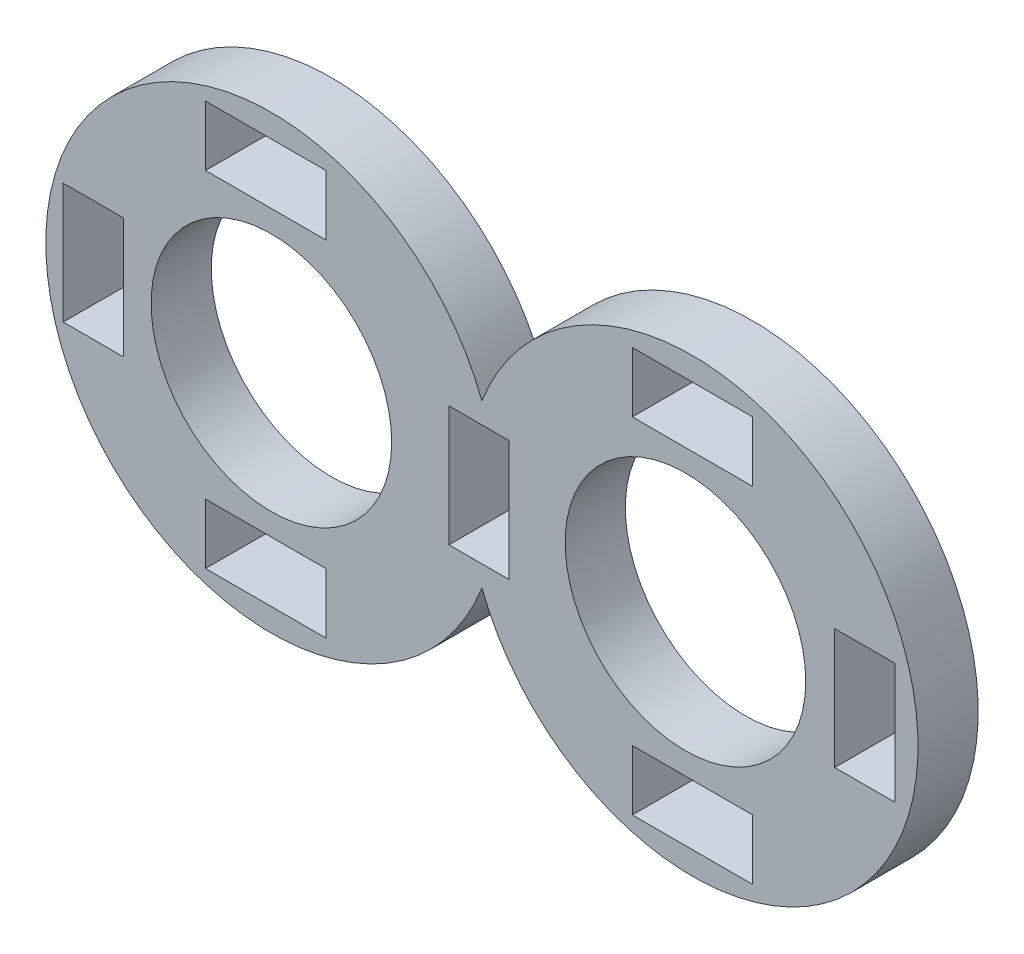
ISO-10303-21;
HEADER;
FILE_DESCRIPTION(('STEP AP214'),'2;1');
FILE_NAME('part.step','',(''),(''),'','','');
FILE_SCHEMA(('AUTOMOTIVE_DESIGN { 1 0 10303 214 1 1 1 1 }'));
ENDSEC;
DATA;
#1=APPLICATION_CONTEXT('core data for automotive mechanical design processes');
#2=APPLICATION_PROTOCOL_DEFINITION('international standard','automotive_design',2000,#1);
#3=PRODUCT_CONTEXT('',#1,'mechanical');
#4=PRODUCT('Part','Part','',(#3));
#5=PRODUCT_RELATED_PRODUCT_CATEGORY('part','',(#4));
#6=PRODUCT_DEFINITION_FORMATION('','',#4);
#7=PRODUCT_DEFINITION_CONTEXT('part definition',#1,'design');
#8=PRODUCT_DEFINITION('design','',#6,#7);
#9=PRODUCT_DEFINITION_SHAPE('','',#8);
#10=(LENGTH_UNIT() NAMED_UNIT(*) SI_UNIT(.MILLI.,.METRE.));
#11=(NAMED_UNIT(*) PLANE_ANGLE_UNIT() SI_UNIT($,.RADIAN.));
#12=(NAMED_UNIT(*) SI_UNIT($,.STERADIAN.) SOLID_ANGLE_UNIT());
#13=UNCERTAINTY_MEASURE_WITH_UNIT(LENGTH_MEASURE(1.E-05),#10,'distance_accuracy_value','');
#14=(GEOMETRIC_REPRESENTATION_CONTEXT(3) GLOBAL_UNCERTAINTY_ASSIGNED_CONTEXT((#13)) GLOBAL_UNIT_ASSIGNED_CONTEXT((#10,
#11,#12)) REPRESENTATION_CONTEXT('',''));
#15=CARTESIAN_POINT('',(0.,0.,0.));
#16=DIRECTION('',(0.,0.,1.));
#17=DIRECTION('',(1.,0.,0.));
#18=AXIS2_PLACEMENT_3D('',#15,#16,#17);
#19=CARTESIAN_POINT('',(0.,0.,1.));
#20=DIRECTION('',(0.,0.,-1.));
#21=DIRECTION('',(-1.,0.,0.));
#22=AXIS2_PLACEMENT_3D('',#19,#20,#21);
#23=CYLINDRICAL_SURFACE('',#22,3.75);
#24=DIRECTION('',(0.,0.,-1.));
#25=VECTOR('',#24,1.);
#26=CARTESIAN_POINT('',(3.5,-1.34629120178362,0.5));
#27=LINE('',#26,#25);
#28=CARTESIAN_POINT('',(3.5,-1.34629120178362,1.));
#29=VERTEX_POINT('',#28);
#30=CARTESIAN_POINT('',(3.5,-1.34629120178362,0.));
#31=VERTEX_POINT('',#30);
#32=EDGE_CURVE('E12',#29,#31,#27,.T.);
#33=ORIENTED_EDGE('',*,*,#32,.F.);
#34=CARTESIAN_POINT('',(0.,0.,1.));
#35=DIRECTION('',(0.,0.,1.));
#36=DIRECTION('',(1.,0.,0.));
#37=AXIS2_PLACEMENT_3D('',#34,#35,#36);
#38=CIRCLE('',#37,3.75);
#39=CARTESIAN_POINT('',(3.5,1.34629120178362,1.));
#40=VERTEX_POINT('',#39);
#41=EDGE_CURVE('E571',#40,#29,#38,.T.);
#42=ORIENTED_EDGE('',*,*,#41,.F.);
#43=DIRECTION('',(0.,0.,-1.));
#44=VECTOR('',#43,1.);
#45=CARTESIAN_POINT('',(3.5,1.34629120178362,0.5));
#46=LINE('',#45,#44);
#47=CARTESIAN_POINT('',(3.5,1.34629120178362,0.));
#48=VERTEX_POINT('',#47);
#49=EDGE_CURVE('E53',#48,#40,#46,.F.);
#50=ORIENTED_EDGE('',*,*,#49,.F.);
#51=CARTESIAN_POINT('',(0.,0.,0.));
#52=DIRECTION('',(0.,0.,1.));
#53=DIRECTION('',(1.,0.,0.));
#54=AXIS2_PLACEMENT_3D('',#51,#52,#53);
#55=CIRCLE('',#54,3.75);
#56=EDGE_CURVE('E575',#48,#31,#55,.T.);
#57=ORIENTED_EDGE('',*,*,#56,.T.);
#58=EDGE_LOOP('',(#33,#42,#50,#57));
#59=FACE_BOUND('',#58,.T.);
#60=ADVANCED_FACE('F44',(#59),#23,.T.);
#61=CARTESIAN_POINT('',(0.,0.,0.));
#62=DIRECTION('',(0.,0.,1.));
#63=DIRECTION('',(1.,0.,0.));
#64=AXIS2_PLACEMENT_3D('',#61,#62,#63);
#65=PLANE('',#64);
#66=DIRECTION('',(1.,0.,0.));
#67=VECTOR('',#66,1.);
#68=CARTESIAN_POINT('',(0.,0.999999999999997,0.));
#69=LINE('',#68,#67);
#70=CARTESIAN_POINT('',(9.36532028956779,0.999999999999997,0.));
#71=VERTEX_POINT('',#70);
#72=CARTESIAN_POINT('',(10.3653202895678,0.999999999999997,0.));
#73=VERTEX_POINT('',#72);
#74=EDGE_CURVE('E278',#71,#73,#69,.T.);
#75=ORIENTED_EDGE('',*,*,#74,.F.);
#76=DIRECTION('',(0.,1.,0.));
#77=VECTOR('',#76,1.);
#78=CARTESIAN_POINT('',(9.36532028956779,0.,0.));
#79=LINE('',#78,#77);
#80=CARTESIAN_POINT('',(9.36532028956779,-1.,0.));
#81=VERTEX_POINT('',#80);
#82=EDGE_CURVE('E60',#81,#71,#79,.T.);
#83=ORIENTED_EDGE('',*,*,#82,.F.);
#84=DIRECTION('',(-1.,0.,0.));
#85=VECTOR('',#84,1.);
#86=CARTESIAN_POINT('',(0.,-1.,0.));
#87=LINE('',#86,#85);
#88=CARTESIAN_POINT('',(10.3653202895678,-1.,0.));
#89=VERTEX_POINT('',#88);
#90=EDGE_CURVE('E265',#89,#81,#87,.T.);
#91=ORIENTED_EDGE('',*,*,#90,.F.);
#92=DIRECTION('',(0.,-1.,0.));
#93=VECTOR('',#92,1.);
#94=CARTESIAN_POINT('',(10.3653202895678,0.,0.));
#95=LINE('',#94,#93);
#96=EDGE_CURVE('E269',#73,#89,#95,.T.);
#97=ORIENTED_EDGE('',*,*,#96,.F.);
#98=EDGE_LOOP('',(#75,#83,#91,#97));
#99=FACE_BOUND('',#98,.T.);
#100=DIRECTION('',(-1.,0.,0.));
#101=VECTOR('',#100,1.);
#102=CARTESIAN_POINT('',(0.,-0.999999999999998,0.));
#103=LINE('',#102,#101);
#104=CARTESIAN_POINT('',(3.95230876838334,-0.999999999999997,0.));
#105=VERTEX_POINT('',#104);
#106=CARTESIAN_POINT('',(2.95230876838334,-0.999999999999997,0.));
#107=VERTEX_POINT('',#106);
#108=EDGE_CURVE('E360',#105,#107,#103,.T.);
#109=ORIENTED_EDGE('',*,*,#108,.F.);
#110=DIRECTION('',(0.,-1.,0.));
#111=VECTOR('',#110,1.);
#112=CARTESIAN_POINT('',(3.95230876838334,0.,0.));
#113=LINE('',#112,#111);
#114=CARTESIAN_POINT('',(3.95230876838334,0.999999999999998,0.));
#115=VERTEX_POINT('',#114);
#116=EDGE_CURVE('E68',#115,#105,#113,.T.);
#117=ORIENTED_EDGE('',*,*,#116,.F.);
#118=DIRECTION('',(1.,0.,0.));
#119=VECTOR('',#118,1.);
#120=CARTESIAN_POINT('',(0.,0.999999999999997,0.));
#121=LINE('',#120,#119);
#122=CARTESIAN_POINT('',(2.95230876838334,0.999999999999997,0.));
#123=VERTEX_POINT('',#122);
#124=EDGE_CURVE('E345',#123,#115,#121,.T.);
#125=ORIENTED_EDGE('',*,*,#124,.F.);
#126=DIRECTION('',(0.,1.,0.));
#127=VECTOR('',#126,1.);
#128=CARTESIAN_POINT('',(2.95230876838334,0.,0.));
#129=LINE('',#128,#127);
#130=EDGE_CURVE('E364',#107,#123,#129,.T.);
#131=ORIENTED_EDGE('',*,*,#130,.F.);
#132=EDGE_LOOP('',(#109,#117,#125,#131));
#133=FACE_BOUND('',#132,.T.);
#134=DIRECTION('',(1.,0.,0.));
#135=VECTOR('',#134,1.);
#136=CARTESIAN_POINT('',(0.,0.999999999999997,0.));
#137=LINE('',#136,#135);
#138=CARTESIAN_POINT('',(-3.46070275280111,0.999999999999997,0.));
#139=VERTEX_POINT('',#138);
#140=CARTESIAN_POINT('',(-2.46070275280111,0.999999999999997,0.));
#141=VERTEX_POINT('',#140);
#142=EDGE_CURVE('E315',#139,#141,#137,.T.);
#143=ORIENTED_EDGE('',*,*,#142,.F.);
#144=DIRECTION('',(0.,1.,0.));
#145=VECTOR('',#144,1.);
#146=CARTESIAN_POINT('',(-3.46070275280111,0.,0.));
#147=LINE('',#146,#145);
#148=CARTESIAN_POINT('',(-3.46070275280111,-1.,0.));
#149=VERTEX_POINT('',#148);
#150=EDGE_CURVE('E312',#149,#139,#147,.T.);
#151=ORIENTED_EDGE('',*,*,#150,.F.);
#152=DIRECTION('',(-1.,0.,0.));
#153=VECTOR('',#152,1.);
#154=CARTESIAN_POINT('',(0.,-1.,0.));
#155=LINE('',#154,#153);
#156=CARTESIAN_POINT('',(-2.46070275280111,-1.,0.));
#157=VERTEX_POINT('',#156);
#158=EDGE_CURVE('E299',#157,#149,#155,.T.);
#159=ORIENTED_EDGE('',*,*,#158,.F.);
#160=DIRECTION('',(0.,-1.,0.));
#161=VECTOR('',#160,1.);
#162=CARTESIAN_POINT('',(-2.46070275280111,0.,0.));
#163=LINE('',#162,#161);
#164=EDGE_CURVE('E320',#141,#157,#163,.T.);
#165=ORIENTED_EDGE('',*,*,#164,.F.);
#166=EDGE_LOOP('',(#143,#151,#159,#165));
#167=FACE_BOUND('',#166,.T.);
#168=DIRECTION('',(0.,-1.,0.));
#169=VECTOR('',#168,1.);
#170=CARTESIAN_POINT('',(0.904617536766678,0.,0.));
#171=LINE('',#170,#169);
#172=CARTESIAN_POINT('',(0.90461753676669,3.36532028956779,0.));
#173=VERTEX_POINT('',#172);
#174=CARTESIAN_POINT('',(0.904617536766687,2.36532028956779,0.));
#175=VERTEX_POINT('',#174);
#176=EDGE_CURVE('E533',#173,#175,#171,.T.);
#177=ORIENTED_EDGE('',*,*,#176,.F.);
#178=DIRECTION('',(1.,0.,0.));
#179=VECTOR('',#178,1.);
#180=CARTESIAN_POINT('',(0.,3.3653202895678,0.));
#181=LINE('',#180,#179);
#182=CARTESIAN_POINT('',(-1.09538246323331,3.3653202895678,0.));
#183=VERTEX_POINT('',#182);
#184=EDGE_CURVE('E330',#183,#173,#181,.T.);
#185=ORIENTED_EDGE('',*,*,#184,.F.);
#186=DIRECTION('',(0.,1.,0.));
#187=VECTOR('',#186,1.);
#188=CARTESIAN_POINT('',(-1.09538246323332,0.,0.));
#189=LINE('',#188,#187);
#190=CARTESIAN_POINT('',(-1.09538246323331,2.3653202895678,0.));
#191=VERTEX_POINT('',#190);
#192=EDGE_CURVE('E518',#191,#183,#189,.T.);
#193=ORIENTED_EDGE('',*,*,#192,.F.);
#194=DIRECTION('',(-1.,0.,0.));
#195=VECTOR('',#194,1.);
#196=CARTESIAN_POINT('',(0.,2.3653202895678,0.));
#197=LINE('',#196,#195);
#198=EDGE_CURVE('E537',#175,#191,#197,.T.);
#199=ORIENTED_EDGE('',*,*,#198,.F.);
#200=EDGE_LOOP('',(#177,#185,#193,#199));
#201=FACE_BOUND('',#200,.T.);
#202=DIRECTION('',(0.,1.,0.));
#203=VECTOR('',#202,1.);
#204=CARTESIAN_POINT('',(6.,0.,0.));
#205=LINE('',#204,#203);
#206=CARTESIAN_POINT('',(5.99999999999999,2.36532028956779,0.));
#207=VERTEX_POINT('',#206);
#208=CARTESIAN_POINT('',(5.99999999999999,3.36532028956779,0.));
#209=VERTEX_POINT('',#208);
#210=EDGE_CURVE('E490',#207,#209,#205,.T.);
#211=ORIENTED_EDGE('',*,*,#210,.F.);
#212=DIRECTION('',(-1.,0.,0.));
#213=VECTOR('',#212,1.);
#214=CARTESIAN_POINT('',(0.,2.36532028956777,0.));
#215=LINE('',#214,#213);
#216=CARTESIAN_POINT('',(7.99999999999999,2.3653202895678,0.));
#217=VERTEX_POINT('',#216);
#218=EDGE_CURVE('E487',#217,#207,#215,.T.);
#219=ORIENTED_EDGE('',*,*,#218,.F.);
#220=DIRECTION('',(0.,-1.,0.));
#221=VECTOR('',#220,1.);
#222=CARTESIAN_POINT('',(8.,0.,0.));
#223=LINE('',#222,#221);
#224=CARTESIAN_POINT('',(7.99999999999999,3.3653202895678,0.));
#225=VERTEX_POINT('',#224);
#226=EDGE_CURVE('E474',#225,#217,#223,.T.);
#227=ORIENTED_EDGE('',*,*,#226,.F.);
#228=DIRECTION('',(1.,0.,0.));
#229=VECTOR('',#228,1.);
#230=CARTESIAN_POINT('',(0.,3.36532028956777,0.));
#231=LINE('',#230,#229);
#232=EDGE_CURVE('E495',#209,#225,#231,.T.);
#233=ORIENTED_EDGE('',*,*,#232,.F.);
#234=EDGE_LOOP('',(#211,#219,#227,#233));
#235=FACE_BOUND('',#234,.T.);
#236=DIRECTION('',(0.,1.,0.));
#237=VECTOR('',#236,1.);
#238=CARTESIAN_POINT('',(-1.09538246323331,0.,0.));
#239=LINE('',#238,#237);
#240=CARTESIAN_POINT('',(-1.0953824632333,-3.3653202895678,0.));
#241=VERTEX_POINT('',#240);
#242=CARTESIAN_POINT('',(-1.09538246323331,-2.3653202895678,0.));
#243=VERTEX_POINT('',#242);
#244=EDGE_CURVE('E446',#241,#243,#239,.T.);
#245=ORIENTED_EDGE('',*,*,#244,.F.);
#246=DIRECTION('',(-1.,0.,0.));
#247=VECTOR('',#246,1.);
#248=CARTESIAN_POINT('',(0.,-3.36532028956779,0.));
#249=LINE('',#248,#247);
#250=CARTESIAN_POINT('',(0.904617536766697,-3.36532028956779,0.));
#251=VERTEX_POINT('',#250);
#252=EDGE_CURVE('E443',#251,#241,#249,.T.);
#253=ORIENTED_EDGE('',*,*,#252,.F.);
#254=DIRECTION('',(0.,-1.,0.));
#255=VECTOR('',#254,1.);
#256=CARTESIAN_POINT('',(0.904617536766685,0.,0.));
#257=LINE('',#256,#255);
#258=CARTESIAN_POINT('',(0.904617536766694,-2.36532028956779,0.));
#259=VERTEX_POINT('',#258);
#260=EDGE_CURVE('E430',#259,#251,#257,.T.);
#261=ORIENTED_EDGE('',*,*,#260,.F.);
#262=DIRECTION('',(1.,0.,0.));
#263=VECTOR('',#262,1.);
#264=CARTESIAN_POINT('',(0.,-2.36532028956779,0.));
#265=LINE('',#264,#263);
#266=EDGE_CURVE('E451',#243,#259,#265,.T.);
#267=ORIENTED_EDGE('',*,*,#266,.F.);
#268=EDGE_LOOP('',(#245,#253,#261,#267));
#269=FACE_BOUND('',#268,.T.);
#270=DIRECTION('',(0.,-1.,0.));
#271=VECTOR('',#270,1.);
#272=CARTESIAN_POINT('',(8.,0.,0.));
#273=LINE('',#272,#271);
#274=CARTESIAN_POINT('',(7.99999999999999,-2.3653202895678,0.));
#275=VERTEX_POINT('',#274);
#276=CARTESIAN_POINT('',(7.99999999999998,-3.3653202895678,0.));
#277=VERTEX_POINT('',#276);
#278=EDGE_CURVE('E402',#275,#277,#273,.T.);
#279=ORIENTED_EDGE('',*,*,#278,.F.);
#280=DIRECTION('',(1.,0.,0.));
#281=VECTOR('',#280,1.);
#282=CARTESIAN_POINT('',(0.,-2.36532028956777,0.));
#283=LINE('',#282,#281);
#284=CARTESIAN_POINT('',(5.99999999999999,-2.36532028956779,0.));
#285=VERTEX_POINT('',#284);
#286=EDGE_CURVE('E399',#285,#275,#283,.T.);
#287=ORIENTED_EDGE('',*,*,#286,.F.);
#288=DIRECTION('',(0.,1.,0.));
#289=VECTOR('',#288,1.);
#290=CARTESIAN_POINT('',(6.,0.,0.));
#291=LINE('',#290,#289);
#292=CARTESIAN_POINT('',(5.99999999999998,-3.36532028956779,0.));
#293=VERTEX_POINT('',#292);
#294=EDGE_CURVE('E386',#293,#285,#291,.T.);
#295=ORIENTED_EDGE('',*,*,#294,.F.);
#296=DIRECTION('',(-1.,0.,0.));
#297=VECTOR('',#296,1.);
#298=CARTESIAN_POINT('',(0.,-3.36532028956777,0.));
#299=LINE('',#298,#297);
#300=EDGE_CURVE('E407',#277,#293,#299,.T.);
#301=ORIENTED_EDGE('',*,*,#300,.F.);
#302=EDGE_LOOP('',(#279,#287,#295,#301));
#303=FACE_BOUND('',#302,.T.);
#304=CARTESIAN_POINT('',(0.,0.,0.));
#305=DIRECTION('',(0.,0.,1.));
#306=DIRECTION('',(1.,0.,0.));
#307=AXIS2_PLACEMENT_3D('',#304,#305,#306);
#308=CIRCLE('',#307,2.);
#309=CARTESIAN_POINT('',(2.,0.,0.));
#310=VERTEX_POINT('',#309);
#311=EDGE_CURVE('E560',#310,#310,#308,.T.);
#312=ORIENTED_EDGE('',*,*,#311,.T.);
#313=EDGE_LOOP('',(#312));
#314=FACE_BOUND('',#313,.T.);
#315=CARTESIAN_POINT('',(6.8834785975013,0.,0.));
#316=DIRECTION('',(0.,0.,1.));
#317=DIRECTION('',(1.,0.,0.));
#318=AXIS2_PLACEMENT_3D('',#315,#316,#317);
#319=CIRCLE('',#318,2.);
#320=CARTESIAN_POINT('',(8.8834785975013,0.,0.));
#321=VERTEX_POINT('',#320);
#322=EDGE_CURVE('E288',#321,#321,#319,.T.);
#323=ORIENTED_EDGE('',*,*,#322,.T.);
#324=EDGE_LOOP('',(#323));
#325=FACE_BOUND('',#324,.T.);
#326=ORIENTED_EDGE('',*,*,#56,.F.);
#327=CARTESIAN_POINT('',(7.,0.,0.));
#328=DIRECTION('',(0.,0.,1.));
#329=DIRECTION('',(1.,0.,0.));
#330=AXIS2_PLACEMENT_3D('',#327,#328,#329);
#331=CIRCLE('',#330,3.75);
#332=EDGE_CURVE('E559',#31,#48,#331,.T.);
#333=ORIENTED_EDGE('',*,*,#332,.F.);
#334=EDGE_LOOP('',(#326,#333));
#335=FACE_BOUND('',#334,.T.);
#336=ADVANCED_FACE('F594',(#99,#133,#167,#201,#235,#269,#303,#314,#325,#335),#65,.F.);
#337=CARTESIAN_POINT('',(0.,0.,1.));
#338=DIRECTION('',(0.,0.,1.));
#339=DIRECTION('',(1.,0.,0.));
#340=AXIS2_PLACEMENT_3D('',#337,#338,#339);
#341=PLANE('',#340);
#342=DIRECTION('',(0.,1.,0.));
#343=VECTOR('',#342,1.);
#344=CARTESIAN_POINT('',(9.36532028956779,0.,1.));
#345=LINE('',#344,#343);
#346=CARTESIAN_POINT('',(9.36532028956779,-1.,1.));
#347=VERTEX_POINT('',#346);
#348=CARTESIAN_POINT('',(9.36532028956779,0.999999999999997,1.));
#349=VERTEX_POINT('',#348);
#350=EDGE_CURVE('E243',#347,#349,#345,.T.);
#351=ORIENTED_EDGE('',*,*,#350,.T.);
#352=DIRECTION('',(1.,0.,0.));
#353=VECTOR('',#352,1.);
#354=CARTESIAN_POINT('',(0.,0.999999999999997,1.));
#355=LINE('',#354,#353);
#356=CARTESIAN_POINT('',(10.3653202895678,0.999999999999997,1.));
#357=VERTEX_POINT('',#356);
#358=EDGE_CURVE('E254',#349,#357,#355,.T.);
#359=ORIENTED_EDGE('',*,*,#358,.T.);
#360=DIRECTION('',(0.,-1.,0.));
#361=VECTOR('',#360,1.);
#362=CARTESIAN_POINT('',(10.3653202895678,0.,1.));
#363=LINE('',#362,#361);
#364=CARTESIAN_POINT('',(10.3653202895678,-1.,1.));
#365=VERTEX_POINT('',#364);
#366=EDGE_CURVE('E259',#357,#365,#363,.T.);
#367=ORIENTED_EDGE('',*,*,#366,.T.);
#368=DIRECTION('',(-1.,0.,0.));
#369=VECTOR('',#368,1.);
#370=CARTESIAN_POINT('',(0.,-1.,1.));
#371=LINE('',#370,#369);
#372=EDGE_CURVE('E250',#365,#347,#371,.T.);
#373=ORIENTED_EDGE('',*,*,#372,.T.);
#374=EDGE_LOOP('',(#351,#359,#367,#373));
#375=FACE_BOUND('',#374,.T.);
#376=DIRECTION('',(0.,-1.,0.));
#377=VECTOR('',#376,1.);
#378=CARTESIAN_POINT('',(3.95230876838334,0.,1.));
#379=LINE('',#378,#377);
#380=CARTESIAN_POINT('',(3.95230876838334,0.999999999999998,1.));
#381=VERTEX_POINT('',#380);
#382=CARTESIAN_POINT('',(3.95230876838334,-0.999999999999997,1.));
#383=VERTEX_POINT('',#382);
#384=EDGE_CURVE('E340',#381,#383,#379,.T.);
#385=ORIENTED_EDGE('',*,*,#384,.T.);
#386=DIRECTION('',(-1.,0.,0.));
#387=VECTOR('',#386,1.);
#388=CARTESIAN_POINT('',(0.,-0.999999999999998,1.));
#389=LINE('',#388,#387);
#390=CARTESIAN_POINT('',(2.95230876838334,-0.999999999999997,1.));
#391=VERTEX_POINT('',#390);
#392=EDGE_CURVE('E344',#383,#391,#389,.T.);
#393=ORIENTED_EDGE('',*,*,#392,.T.);
#394=DIRECTION('',(0.,1.,0.));
#395=VECTOR('',#394,1.);
#396=CARTESIAN_POINT('',(2.95230876838334,0.,1.));
#397=LINE('',#396,#395);
#398=CARTESIAN_POINT('',(2.95230876838334,0.999999999999997,1.));
#399=VERTEX_POINT('',#398);
#400=EDGE_CURVE('E349',#391,#399,#397,.T.);
#401=ORIENTED_EDGE('',*,*,#400,.T.);
#402=DIRECTION('',(1.,0.,0.));
#403=VECTOR('',#402,1.);
#404=CARTESIAN_POINT('',(0.,0.999999999999997,1.));
#405=LINE('',#404,#403);
#406=EDGE_CURVE('E353',#399,#381,#405,.T.);
#407=ORIENTED_EDGE('',*,*,#406,.T.);
#408=EDGE_LOOP('',(#385,#393,#401,#407));
#409=FACE_BOUND('',#408,.T.);
#410=DIRECTION('',(0.,1.,0.));
#411=VECTOR('',#410,1.);
#412=CARTESIAN_POINT('',(-3.46070275280111,0.,1.));
#413=LINE('',#412,#411);
#414=CARTESIAN_POINT('',(-3.46070275280111,-1.,1.));
#415=VERTEX_POINT('',#414);
#416=CARTESIAN_POINT('',(-3.46070275280111,0.999999999999997,1.));
#417=VERTEX_POINT('',#416);
#418=EDGE_CURVE('E294',#415,#417,#413,.T.);
#419=ORIENTED_EDGE('',*,*,#418,.T.);
#420=DIRECTION('',(1.,0.,0.));
#421=VECTOR('',#420,1.);
#422=CARTESIAN_POINT('',(0.,0.999999999999997,1.));
#423=LINE('',#422,#421);
#424=CARTESIAN_POINT('',(-2.46070275280111,0.999999999999997,1.));
#425=VERTEX_POINT('',#424);
#426=EDGE_CURVE('E298',#417,#425,#423,.T.);
#427=ORIENTED_EDGE('',*,*,#426,.T.);
#428=DIRECTION('',(0.,-1.,0.));
#429=VECTOR('',#428,1.);
#430=CARTESIAN_POINT('',(-2.46070275280111,0.,1.));
#431=LINE('',#430,#429);
#432=CARTESIAN_POINT('',(-2.46070275280111,-1.,1.));
#433=VERTEX_POINT('',#432);
#434=EDGE_CURVE('E303',#425,#433,#431,.T.);
#435=ORIENTED_EDGE('',*,*,#434,.T.);
#436=DIRECTION('',(-1.,0.,0.));
#437=VECTOR('',#436,1.);
#438=CARTESIAN_POINT('',(0.,-1.,1.));
#439=LINE('',#438,#437);
#440=EDGE_CURVE('E307',#433,#415,#439,.T.);
#441=ORIENTED_EDGE('',*,*,#440,.T.);
#442=EDGE_LOOP('',(#419,#427,#435,#441));
#443=FACE_BOUND('',#442,.T.);
#444=DIRECTION('',(1.,0.,0.));
#445=VECTOR('',#444,1.);
#446=CARTESIAN_POINT('',(0.,3.3653202895678,1.));
#447=LINE('',#446,#445);
#448=CARTESIAN_POINT('',(-1.09538246323331,3.3653202895678,1.));
#449=VERTEX_POINT('',#448);
#450=CARTESIAN_POINT('',(0.90461753676669,3.36532028956779,1.));
#451=VERTEX_POINT('',#450);
#452=EDGE_CURVE('E513',#449,#451,#447,.T.);
#453=ORIENTED_EDGE('',*,*,#452,.T.);
#454=DIRECTION('',(0.,-1.,0.));
#455=VECTOR('',#454,1.);
#456=CARTESIAN_POINT('',(0.904617536766678,0.,1.));
#457=LINE('',#456,#455);
#458=CARTESIAN_POINT('',(0.904617536766687,2.36532028956779,1.));
#459=VERTEX_POINT('',#458);
#460=EDGE_CURVE('E517',#451,#459,#457,.T.);
#461=ORIENTED_EDGE('',*,*,#460,.T.);
#462=DIRECTION('',(-1.,0.,0.));
#463=VECTOR('',#462,1.);
#464=CARTESIAN_POINT('',(0.,2.3653202895678,1.));
#465=LINE('',#464,#463);
#466=CARTESIAN_POINT('',(-1.09538246323331,2.3653202895678,1.));
#467=VERTEX_POINT('',#466);
#468=EDGE_CURVE('E522',#459,#467,#465,.T.);
#469=ORIENTED_EDGE('',*,*,#468,.T.);
#470=DIRECTION('',(0.,1.,0.));
#471=VECTOR('',#470,1.);
#472=CARTESIAN_POINT('',(-1.09538246323332,0.,1.));
#473=LINE('',#472,#471);
#474=EDGE_CURVE('E526',#467,#449,#473,.T.);
#475=ORIENTED_EDGE('',*,*,#474,.T.);
#476=EDGE_LOOP('',(#453,#461,#469,#475));
#477=FACE_BOUND('',#476,.T.);
#478=DIRECTION('',(-1.,0.,0.));
#479=VECTOR('',#478,1.);
#480=CARTESIAN_POINT('',(0.,2.36532028956777,1.));
#481=LINE('',#480,#479);
#482=CARTESIAN_POINT('',(7.99999999999999,2.3653202895678,1.));
#483=VERTEX_POINT('',#482);
#484=CARTESIAN_POINT('',(5.99999999999999,2.36532028956779,1.));
#485=VERTEX_POINT('',#484);
#486=EDGE_CURVE('E469',#483,#485,#481,.T.);
#487=ORIENTED_EDGE('',*,*,#486,.T.);
#488=DIRECTION('',(0.,1.,0.));
#489=VECTOR('',#488,1.);
#490=CARTESIAN_POINT('',(6.,0.,1.));
#491=LINE('',#490,#489);
#492=CARTESIAN_POINT('',(5.99999999999999,3.36532028956779,1.));
#493=VERTEX_POINT('',#492);
#494=EDGE_CURVE('E473',#485,#493,#491,.T.);
#495=ORIENTED_EDGE('',*,*,#494,.T.);
#496=DIRECTION('',(1.,0.,0.));
#497=VECTOR('',#496,1.);
#498=CARTESIAN_POINT('',(0.,3.36532028956777,1.));
#499=LINE('',#498,#497);
#500=CARTESIAN_POINT('',(7.99999999999999,3.3653202895678,1.));
#501=VERTEX_POINT('',#500);
#502=EDGE_CURVE('E478',#493,#501,#499,.T.);
#503=ORIENTED_EDGE('',*,*,#502,.T.);
#504=DIRECTION('',(0.,-1.,0.));
#505=VECTOR('',#504,1.);
#506=CARTESIAN_POINT('',(8.,0.,1.));
#507=LINE('',#506,#505);
#508=EDGE_CURVE('E482',#501,#483,#507,.T.);
#509=ORIENTED_EDGE('',*,*,#508,.T.);
#510=EDGE_LOOP('',(#487,#495,#503,#509));
#511=FACE_BOUND('',#510,.T.);
#512=DIRECTION('',(-1.,0.,0.));
#513=VECTOR('',#512,1.);
#514=CARTESIAN_POINT('',(0.,-3.36532028956779,1.));
#515=LINE('',#514,#513);
#516=CARTESIAN_POINT('',(0.904617536766697,-3.36532028956779,1.));
#517=VERTEX_POINT('',#516);
#518=CARTESIAN_POINT('',(-1.0953824632333,-3.3653202895678,1.));
#519=VERTEX_POINT('',#518);
#520=EDGE_CURVE('E425',#517,#519,#515,.T.);
#521=ORIENTED_EDGE('',*,*,#520,.T.);
#522=DIRECTION('',(0.,1.,0.));
#523=VECTOR('',#522,1.);
#524=CARTESIAN_POINT('',(-1.09538246323331,0.,1.));
#525=LINE('',#524,#523);
#526=CARTESIAN_POINT('',(-1.09538246323331,-2.3653202895678,1.));
#527=VERTEX_POINT('',#526);
#528=EDGE_CURVE('E429',#519,#527,#525,.T.);
#529=ORIENTED_EDGE('',*,*,#528,.T.);
#530=DIRECTION('',(1.,0.,0.));
#531=VECTOR('',#530,1.);
#532=CARTESIAN_POINT('',(0.,-2.36532028956779,1.));
#533=LINE('',#532,#531);
#534=CARTESIAN_POINT('',(0.904617536766694,-2.36532028956779,1.));
#535=VERTEX_POINT('',#534);
#536=EDGE_CURVE('E434',#527,#535,#533,.T.);
#537=ORIENTED_EDGE('',*,*,#536,.T.);
#538=DIRECTION('',(0.,-1.,0.));
#539=VECTOR('',#538,1.);
#540=CARTESIAN_POINT('',(0.904617536766685,0.,1.));
#541=LINE('',#540,#539);
#542=EDGE_CURVE('E438',#535,#517,#541,.T.);
#543=ORIENTED_EDGE('',*,*,#542,.T.);
#544=EDGE_LOOP('',(#521,#529,#537,#543));
#545=FACE_BOUND('',#544,.T.);
#546=DIRECTION('',(1.,0.,0.));
#547=VECTOR('',#546,1.);
#548=CARTESIAN_POINT('',(0.,-2.36532028956777,1.));
#549=LINE('',#548,#547);
#550=CARTESIAN_POINT('',(5.99999999999999,-2.36532028956779,1.));
#551=VERTEX_POINT('',#550);
#552=CARTESIAN_POINT('',(7.99999999999999,-2.3653202895678,1.));
#553=VERTEX_POINT('',#552);
#554=EDGE_CURVE('E381',#551,#553,#549,.T.);
#555=ORIENTED_EDGE('',*,*,#554,.T.);
#556=DIRECTION('',(0.,-1.,0.));
#557=VECTOR('',#556,1.);
#558=CARTESIAN_POINT('',(8.,0.,1.));
#559=LINE('',#558,#557);
#560=CARTESIAN_POINT('',(7.99999999999998,-3.3653202895678,1.));
#561=VERTEX_POINT('',#560);
#562=EDGE_CURVE('E385',#553,#561,#559,.T.);
#563=ORIENTED_EDGE('',*,*,#562,.T.);
#564=DIRECTION('',(-1.,0.,0.));
#565=VECTOR('',#564,1.);
#566=CARTESIAN_POINT('',(0.,-3.36532028956777,1.));
#567=LINE('',#566,#565);
#568=CARTESIAN_POINT('',(5.99999999999998,-3.36532028956779,1.));
#569=VERTEX_POINT('',#568);
#570=EDGE_CURVE('E390',#561,#569,#567,.T.);
#571=ORIENTED_EDGE('',*,*,#570,.T.);
#572=DIRECTION('',(0.,1.,0.));
#573=VECTOR('',#572,1.);
#574=CARTESIAN_POINT('',(6.,0.,1.));
#575=LINE('',#574,#573);
#576=EDGE_CURVE('E394',#569,#551,#575,.T.);
#577=ORIENTED_EDGE('',*,*,#576,.T.);
#578=EDGE_LOOP('',(#555,#563,#571,#577));
#579=FACE_BOUND('',#578,.T.);
#580=CARTESIAN_POINT('',(0.,0.,1.));
#581=DIRECTION('',(0.,0.,1.));
#582=DIRECTION('',(1.,0.,0.));
#583=AXIS2_PLACEMENT_3D('',#580,#581,#582);
#584=CIRCLE('',#583,2.);
#585=CARTESIAN_POINT('',(2.,0.,1.));
#586=VERTEX_POINT('',#585);
#587=EDGE_CURVE('E555',#586,#586,#584,.T.);
#588=ORIENTED_EDGE('',*,*,#587,.F.);
#589=EDGE_LOOP('',(#588));
#590=FACE_BOUND('',#589,.T.);
#591=CARTESIAN_POINT('',(6.8834785975013,0.,1.));
#592=DIRECTION('',(0.,0.,1.));
#593=DIRECTION('',(1.,0.,0.));
#594=AXIS2_PLACEMENT_3D('',#591,#592,#593);
#595=CIRCLE('',#594,2.);
#596=CARTESIAN_POINT('',(8.8834785975013,0.,1.));
#597=VERTEX_POINT('',#596);
#598=EDGE_CURVE('E564',#597,#597,#595,.T.);
#599=ORIENTED_EDGE('',*,*,#598,.F.);
#600=EDGE_LOOP('',(#599));
#601=FACE_BOUND('',#600,.T.);
#602=ORIENTED_EDGE('',*,*,#41,.T.);
#603=CARTESIAN_POINT('',(7.,0.,1.));
#604=DIRECTION('',(0.,0.,1.));
#605=DIRECTION('',(1.,0.,0.));
#606=AXIS2_PLACEMENT_3D('',#603,#604,#605);
#607=CIRCLE('',#606,3.75);
#608=EDGE_CURVE('E579',#29,#40,#607,.T.);
#609=ORIENTED_EDGE('',*,*,#608,.T.);
#610=EDGE_LOOP('',(#602,#609));
#611=FACE_BOUND('',#610,.T.);
#612=ADVANCED_FACE('F261',(#375,#409,#443,#477,#511,#545,#579,#590,#601,#611),#341,.T.);
#613=CARTESIAN_POINT('',(7.,0.,1.));
#614=DIRECTION('',(0.,0.,-1.));
#615=DIRECTION('',(-1.,0.,0.));
#616=AXIS2_PLACEMENT_3D('',#613,#614,#615);
#617=CYLINDRICAL_SURFACE('',#616,3.75);
#618=ORIENTED_EDGE('',*,*,#608,.F.);
#619=ORIENTED_EDGE('',*,*,#32,.T.);
#620=ORIENTED_EDGE('',*,*,#332,.T.);
#621=ORIENTED_EDGE('',*,*,#49,.T.);
#622=EDGE_LOOP('',(#618,#619,#620,#621));
#623=FACE_BOUND('',#622,.T.);
#624=ADVANCED_FACE('F46',(#623),#617,.T.);
#625=CARTESIAN_POINT('',(6.8834785975013,0.,1.));
#626=DIRECTION('',(0.,0.,-1.));
#627=DIRECTION('',(-1.,0.,0.));
#628=AXIS2_PLACEMENT_3D('',#625,#626,#627);
#629=CYLINDRICAL_SURFACE('',#628,2.);
#630=ORIENTED_EDGE('',*,*,#598,.T.);
#631=EDGE_LOOP('',(#630));
#632=FACE_BOUND('',#631,.T.);
#633=ORIENTED_EDGE('',*,*,#322,.F.);
#634=EDGE_LOOP('',(#633));
#635=FACE_BOUND('',#634,.T.);
#636=ADVANCED_FACE('F606',(#632,#635),#629,.F.);
#637=CARTESIAN_POINT('',(0.,0.,1.));
#638=DIRECTION('',(0.,0.,-1.));
#639=DIRECTION('',(-1.,0.,0.));
#640=AXIS2_PLACEMENT_3D('',#637,#638,#639);
#641=CYLINDRICAL_SURFACE('',#640,2.);
#642=ORIENTED_EDGE('',*,*,#587,.T.);
#643=EDGE_LOOP('',(#642));
#644=FACE_BOUND('',#643,.T.);
#645=ORIENTED_EDGE('',*,*,#311,.F.);
#646=EDGE_LOOP('',(#645));
#647=FACE_BOUND('',#646,.T.);
#648=ADVANCED_FACE('F609',(#644,#647),#641,.F.);
#649=CARTESIAN_POINT('',(0.,-2.36532028956777,1.));
#650=DIRECTION('',(0.,1.,0.));
#651=DIRECTION('',(-1.,0.,0.));
#652=AXIS2_PLACEMENT_3D('',#649,#650,#651);
#653=PLANE('',#652);
#654=ORIENTED_EDGE('',*,*,#286,.T.);
#655=DIRECTION('',(0.,0.,-1.));
#656=VECTOR('',#655,1.);
#657=CARTESIAN_POINT('',(7.99999999999999,-2.3653202895678,1.));
#658=LINE('',#657,#656);
#659=EDGE_CURVE('E398',#553,#275,#658,.T.);
#660=ORIENTED_EDGE('',*,*,#659,.F.);
#661=ORIENTED_EDGE('',*,*,#554,.F.);
#662=DIRECTION('',(0.,0.,-1.));
#663=VECTOR('',#662,1.);
#664=CARTESIAN_POINT('',(5.99999999999999,-2.36532028956779,1.));
#665=LINE('',#664,#663);
#666=EDGE_CURVE('E279',#551,#285,#665,.T.);
#667=ORIENTED_EDGE('',*,*,#666,.T.);
#668=EDGE_LOOP('',(#654,#660,#661,#667));
#669=FACE_BOUND('',#668,.T.);
#670=ADVANCED_FACE('F613',(#669),#653,.F.);
#671=CARTESIAN_POINT('',(6.,0.,1.));
#672=DIRECTION('',(-1.,0.,0.));
#673=DIRECTION('',(0.,-1.,0.));
#674=AXIS2_PLACEMENT_3D('',#671,#672,#673);
#675=PLANE('',#674);
#676=ORIENTED_EDGE('',*,*,#294,.T.);
#677=ORIENTED_EDGE('',*,*,#666,.F.);
#678=ORIENTED_EDGE('',*,*,#576,.F.);
#679=DIRECTION('',(0.,0.,-1.));
#680=VECTOR('',#679,1.);
#681=CARTESIAN_POINT('',(5.99999999999998,-3.36532028956779,1.));
#682=LINE('',#681,#680);
#683=EDGE_CURVE('E416',#569,#293,#682,.T.);
#684=ORIENTED_EDGE('',*,*,#683,.T.);
#685=EDGE_LOOP('',(#676,#677,#678,#684));
#686=FACE_BOUND('',#685,.T.);
#687=ADVANCED_FACE('F667',(#686),#675,.F.);
#688=CARTESIAN_POINT('',(0.,-3.36532028956777,1.));
#689=DIRECTION('',(0.,-1.,0.));
#690=DIRECTION('',(1.,0.,0.));
#691=AXIS2_PLACEMENT_3D('',#688,#689,#690);
#692=PLANE('',#691);
#693=ORIENTED_EDGE('',*,*,#300,.T.);
#694=ORIENTED_EDGE('',*,*,#683,.F.);
#695=ORIENTED_EDGE('',*,*,#570,.F.);
#696=DIRECTION('',(0.,0.,-1.));
#697=VECTOR('',#696,1.);
#698=CARTESIAN_POINT('',(7.99999999999998,-3.3653202895678,1.));
#699=LINE('',#698,#697);
#700=EDGE_CURVE('E419',#561,#277,#699,.T.);
#701=ORIENTED_EDGE('',*,*,#700,.T.);
#702=EDGE_LOOP('',(#693,#694,#695,#701));
#703=FACE_BOUND('',#702,.T.);
#704=ADVANCED_FACE('F671',(#703),#692,.F.);
#705=CARTESIAN_POINT('',(8.,0.,1.));
#706=DIRECTION('',(1.,0.,0.));
#707=DIRECTION('',(0.,1.,0.));
#708=AXIS2_PLACEMENT_3D('',#705,#706,#707);
#709=PLANE('',#708);
#710=ORIENTED_EDGE('',*,*,#278,.T.);
#711=ORIENTED_EDGE('',*,*,#700,.F.);
#712=ORIENTED_EDGE('',*,*,#562,.F.);
#713=ORIENTED_EDGE('',*,*,#659,.T.);
#714=EDGE_LOOP('',(#710,#711,#712,#713));
#715=FACE_BOUND('',#714,.T.);
#716=ADVANCED_FACE('F653',(#715),#709,.F.);
#717=CARTESIAN_POINT('',(0.,-3.36532028956779,1.));
#718=DIRECTION('',(0.,-1.,0.));
#719=DIRECTION('',(1.,0.,0.));
#720=AXIS2_PLACEMENT_3D('',#717,#718,#719);
#721=PLANE('',#720);
#722=ORIENTED_EDGE('',*,*,#252,.T.);
#723=DIRECTION('',(0.,0.,-1.));
#724=VECTOR('',#723,1.);
#725=CARTESIAN_POINT('',(-1.0953824632333,-3.3653202895678,1.));
#726=LINE('',#725,#724);
#727=EDGE_CURVE('E442',#519,#241,#726,.T.);
#728=ORIENTED_EDGE('',*,*,#727,.F.);
#729=ORIENTED_EDGE('',*,*,#520,.F.);
#730=DIRECTION('',(0.,0.,-1.));
#731=VECTOR('',#730,1.);
#732=CARTESIAN_POINT('',(0.904617536766697,-3.36532028956779,1.));
#733=LINE('',#732,#731);
#734=EDGE_CURVE('E403',#517,#251,#733,.T.);
#735=ORIENTED_EDGE('',*,*,#734,.T.);
#736=EDGE_LOOP('',(#722,#728,#729,#735));
#737=FACE_BOUND('',#736,.T.);
#738=ADVANCED_FACE('F649',(#737),#721,.F.);
#739=CARTESIAN_POINT('',(0.904617536766685,0.,1.));
#740=DIRECTION('',(1.,0.,0.));
#741=DIRECTION('',(0.,1.,0.));
#742=AXIS2_PLACEMENT_3D('',#739,#740,#741);
#743=PLANE('',#742);
#744=ORIENTED_EDGE('',*,*,#260,.T.);
#745=ORIENTED_EDGE('',*,*,#734,.F.);
#746=ORIENTED_EDGE('',*,*,#542,.F.);
#747=DIRECTION('',(0.,0.,-1.));
#748=VECTOR('',#747,1.);
#749=CARTESIAN_POINT('',(0.904617536766694,-2.36532028956779,1.));
#750=LINE('',#749,#748);
#751=EDGE_CURVE('E460',#535,#259,#750,.T.);
#752=ORIENTED_EDGE('',*,*,#751,.T.);
#753=EDGE_LOOP('',(#744,#745,#746,#752));
#754=FACE_BOUND('',#753,.T.);
#755=ADVANCED_FACE('F652',(#754),#743,.F.);
#756=CARTESIAN_POINT('',(0.,-2.36532028956779,1.));
#757=DIRECTION('',(0.,1.,0.));
#758=DIRECTION('',(-1.,0.,0.));
#759=AXIS2_PLACEMENT_3D('',#756,#757,#758);
#760=PLANE('',#759);
#761=ORIENTED_EDGE('',*,*,#266,.T.);
#762=ORIENTED_EDGE('',*,*,#751,.F.);
#763=ORIENTED_EDGE('',*,*,#536,.F.);
#764=DIRECTION('',(0.,0.,-1.));
#765=VECTOR('',#764,1.);
#766=CARTESIAN_POINT('',(-1.09538246323331,-2.3653202895678,1.));
#767=LINE('',#766,#765);
#768=EDGE_CURVE('E463',#527,#243,#767,.T.);
#769=ORIENTED_EDGE('',*,*,#768,.T.);
#770=EDGE_LOOP('',(#761,#762,#763,#769));
#771=FACE_BOUND('',#770,.T.);
#772=ADVANCED_FACE('F657',(#771),#760,.F.);
#773=CARTESIAN_POINT('',(-1.09538246323331,0.,1.));
#774=DIRECTION('',(-1.,0.,0.));
#775=DIRECTION('',(0.,-1.,0.));
#776=AXIS2_PLACEMENT_3D('',#773,#774,#775);
#777=PLANE('',#776);
#778=ORIENTED_EDGE('',*,*,#244,.T.);
#779=ORIENTED_EDGE('',*,*,#768,.F.);
#780=ORIENTED_EDGE('',*,*,#528,.F.);
#781=ORIENTED_EDGE('',*,*,#727,.T.);
#782=EDGE_LOOP('',(#778,#779,#780,#781));
#783=FACE_BOUND('',#782,.T.);
#784=ADVANCED_FACE('F637',(#783),#777,.F.);
#785=CARTESIAN_POINT('',(0.,2.36532028956777,1.));
#786=DIRECTION('',(0.,-1.,0.));
#787=DIRECTION('',(1.,0.,0.));
#788=AXIS2_PLACEMENT_3D('',#785,#786,#787);
#789=PLANE('',#788);
#790=ORIENTED_EDGE('',*,*,#218,.T.);
#791=DIRECTION('',(0.,0.,-1.));
#792=VECTOR('',#791,1.);
#793=CARTESIAN_POINT('',(5.99999999999999,2.36532028956779,1.));
#794=LINE('',#793,#792);
#795=EDGE_CURVE('E486',#485,#207,#794,.T.);
#796=ORIENTED_EDGE('',*,*,#795,.F.);
#797=ORIENTED_EDGE('',*,*,#486,.F.);
#798=DIRECTION('',(0.,0.,-1.));
#799=VECTOR('',#798,1.);
#800=CARTESIAN_POINT('',(7.99999999999999,2.3653202895678,1.));
#801=LINE('',#800,#799);
#802=EDGE_CURVE('E447',#483,#217,#801,.T.);
#803=ORIENTED_EDGE('',*,*,#802,.T.);
#804=EDGE_LOOP('',(#790,#796,#797,#803));
#805=FACE_BOUND('',#804,.T.);
#806=ADVANCED_FACE('F633',(#805),#789,.F.);
#807=CARTESIAN_POINT('',(8.,0.,1.));
#808=DIRECTION('',(1.,0.,0.));
#809=DIRECTION('',(0.,1.,0.));
#810=AXIS2_PLACEMENT_3D('',#807,#808,#809);
#811=PLANE('',#810);
#812=ORIENTED_EDGE('',*,*,#226,.T.);
#813=ORIENTED_EDGE('',*,*,#802,.F.);
#814=ORIENTED_EDGE('',*,*,#508,.F.);
#815=DIRECTION('',(0.,0.,-1.));
#816=VECTOR('',#815,1.);
#817=CARTESIAN_POINT('',(7.99999999999999,3.3653202895678,1.));
#818=LINE('',#817,#816);
#819=EDGE_CURVE('E504',#501,#225,#818,.T.);
#820=ORIENTED_EDGE('',*,*,#819,.T.);
#821=EDGE_LOOP('',(#812,#813,#814,#820));
#822=FACE_BOUND('',#821,.T.);
#823=ADVANCED_FACE('F636',(#822),#811,.F.);
#824=CARTESIAN_POINT('',(0.,3.36532028956777,1.));
#825=DIRECTION('',(0.,1.,0.));
#826=DIRECTION('',(-1.,0.,0.));
#827=AXIS2_PLACEMENT_3D('',#824,#825,#826);
#828=PLANE('',#827);
#829=ORIENTED_EDGE('',*,*,#232,.T.);
#830=ORIENTED_EDGE('',*,*,#819,.F.);
#831=ORIENTED_EDGE('',*,*,#502,.F.);
#832=DIRECTION('',(0.,0.,-1.));
#833=VECTOR('',#832,1.);
#834=CARTESIAN_POINT('',(5.99999999999999,3.36532028956779,1.));
#835=LINE('',#834,#833);
#836=EDGE_CURVE('E507',#493,#209,#835,.T.);
#837=ORIENTED_EDGE('',*,*,#836,.T.);
#838=EDGE_LOOP('',(#829,#830,#831,#837));
#839=FACE_BOUND('',#838,.T.);
#840=ADVANCED_FACE('F641',(#839),#828,.F.);
#841=CARTESIAN_POINT('',(6.,0.,1.));
#842=DIRECTION('',(-1.,0.,0.));
#843=DIRECTION('',(0.,-1.,0.));
#844=AXIS2_PLACEMENT_3D('',#841,#842,#843);
#845=PLANE('',#844);
#846=ORIENTED_EDGE('',*,*,#210,.T.);
#847=ORIENTED_EDGE('',*,*,#836,.F.);
#848=ORIENTED_EDGE('',*,*,#494,.F.);
#849=ORIENTED_EDGE('',*,*,#795,.T.);
#850=EDGE_LOOP('',(#846,#847,#848,#849));
#851=FACE_BOUND('',#850,.T.);
#852=ADVANCED_FACE('F619',(#851),#845,.F.);
#853=CARTESIAN_POINT('',(0.,3.3653202895678,1.));
#854=DIRECTION('',(0.,1.,0.));
#855=DIRECTION('',(-1.,0.,0.));
#856=AXIS2_PLACEMENT_3D('',#853,#854,#855);
#857=PLANE('',#856);
#858=ORIENTED_EDGE('',*,*,#184,.T.);
#859=DIRECTION('',(0.,0.,-1.));
#860=VECTOR('',#859,1.);
#861=CARTESIAN_POINT('',(0.90461753676669,3.36532028956779,1.));
#862=LINE('',#861,#860);
#863=EDGE_CURVE('E530',#451,#173,#862,.T.);
#864=ORIENTED_EDGE('',*,*,#863,.F.);
#865=ORIENTED_EDGE('',*,*,#452,.F.);
#866=DIRECTION('',(0.,0.,-1.));
#867=VECTOR('',#866,1.);
#868=CARTESIAN_POINT('',(-1.09538246323331,3.3653202895678,1.));
#869=LINE('',#868,#867);
#870=EDGE_CURVE('E491',#449,#183,#869,.T.);
#871=ORIENTED_EDGE('',*,*,#870,.T.);
#872=EDGE_LOOP('',(#858,#864,#865,#871));
#873=FACE_BOUND('',#872,.T.);
#874=ADVANCED_FACE('F615',(#873),#857,.F.);
#875=CARTESIAN_POINT('',(-1.09538246323332,0.,1.));
#876=DIRECTION('',(-1.,0.,0.));
#877=DIRECTION('',(0.,-1.,0.));
#878=AXIS2_PLACEMENT_3D('',#875,#876,#877);
#879=PLANE('',#878);
#880=ORIENTED_EDGE('',*,*,#192,.T.);
#881=ORIENTED_EDGE('',*,*,#870,.F.);
#882=ORIENTED_EDGE('',*,*,#474,.F.);
#883=DIRECTION('',(0.,0.,-1.));
#884=VECTOR('',#883,1.);
#885=CARTESIAN_POINT('',(-1.09538246323331,2.3653202895678,1.));
#886=LINE('',#885,#884);
#887=EDGE_CURVE('E546',#467,#191,#886,.T.);
#888=ORIENTED_EDGE('',*,*,#887,.T.);
#889=EDGE_LOOP('',(#880,#881,#882,#888));
#890=FACE_BOUND('',#889,.T.);
#891=ADVANCED_FACE('F618',(#890),#879,.F.);
#892=CARTESIAN_POINT('',(0.,2.3653202895678,1.));
#893=DIRECTION('',(0.,-1.,0.));
#894=DIRECTION('',(1.,0.,0.));
#895=AXIS2_PLACEMENT_3D('',#892,#893,#894);
#896=PLANE('',#895);
#897=ORIENTED_EDGE('',*,*,#198,.T.);
#898=ORIENTED_EDGE('',*,*,#887,.F.);
#899=ORIENTED_EDGE('',*,*,#468,.F.);
#900=DIRECTION('',(0.,0.,-1.));
#901=VECTOR('',#900,1.);
#902=CARTESIAN_POINT('',(0.904617536766687,2.36532028956779,1.));
#903=LINE('',#902,#901);
#904=EDGE_CURVE('E549',#459,#175,#903,.T.);
#905=ORIENTED_EDGE('',*,*,#904,.T.);
#906=EDGE_LOOP('',(#897,#898,#899,#905));
#907=FACE_BOUND('',#906,.T.);
#908=ADVANCED_FACE('F625',(#907),#896,.F.);
#909=CARTESIAN_POINT('',(0.904617536766678,0.,1.));
#910=DIRECTION('',(1.,0.,0.));
#911=DIRECTION('',(0.,1.,0.));
#912=AXIS2_PLACEMENT_3D('',#909,#910,#911);
#913=PLANE('',#912);
#914=ORIENTED_EDGE('',*,*,#176,.T.);
#915=ORIENTED_EDGE('',*,*,#904,.F.);
#916=ORIENTED_EDGE('',*,*,#460,.F.);
#917=ORIENTED_EDGE('',*,*,#863,.T.);
#918=EDGE_LOOP('',(#914,#915,#916,#917));
#919=FACE_BOUND('',#918,.T.);
#920=ADVANCED_FACE('F621',(#919),#913,.F.);
#921=CARTESIAN_POINT('',(-3.46070275280111,0.,1.));
#922=DIRECTION('',(-1.,0.,0.));
#923=DIRECTION('',(0.,0.,1.));
#924=AXIS2_PLACEMENT_3D('',#921,#922,#923);
#925=PLANE('',#924);
#926=ORIENTED_EDGE('',*,*,#150,.T.);
#927=DIRECTION('',(0.,0.,-1.));
#928=VECTOR('',#927,1.);
#929=CARTESIAN_POINT('',(-3.46070275280111,0.999999999999997,1.));
#930=LINE('',#929,#928);
#931=EDGE_CURVE('E311',#417,#139,#930,.T.);
#932=ORIENTED_EDGE('',*,*,#931,.F.);
#933=ORIENTED_EDGE('',*,*,#418,.F.);
#934=DIRECTION('',(0.,0.,-1.));
#935=VECTOR('',#934,1.);
#936=CARTESIAN_POINT('',(-3.46070275280111,-1.,1.));
#937=LINE('',#936,#935);
#938=EDGE_CURVE('E327',#415,#149,#937,.T.);
#939=ORIENTED_EDGE('',*,*,#938,.T.);
#940=EDGE_LOOP('',(#926,#932,#933,#939));
#941=FACE_BOUND('',#940,.T.);
#942=ADVANCED_FACE('F624',(#941),#925,.F.);
#943=CARTESIAN_POINT('',(0.,-1.,1.));
#944=DIRECTION('',(0.,-1.,0.));
#945=DIRECTION('',(0.,0.,-1.));
#946=AXIS2_PLACEMENT_3D('',#943,#944,#945);
#947=PLANE('',#946);
#948=ORIENTED_EDGE('',*,*,#158,.T.);
#949=ORIENTED_EDGE('',*,*,#938,.F.);
#950=ORIENTED_EDGE('',*,*,#440,.F.);
#951=DIRECTION('',(0.,0.,-1.));
#952=VECTOR('',#951,1.);
#953=CARTESIAN_POINT('',(-2.46070275280111,-1.,1.));
#954=LINE('',#953,#952);
#955=EDGE_CURVE('E331',#433,#157,#954,.T.);
#956=ORIENTED_EDGE('',*,*,#955,.T.);
#957=EDGE_LOOP('',(#948,#949,#950,#956));
#958=FACE_BOUND('',#957,.T.);
#959=ADVANCED_FACE('F697',(#958),#947,.F.);
#960=CARTESIAN_POINT('',(-2.46070275280111,0.,1.));
#961=DIRECTION('',(1.,0.,0.));
#962=DIRECTION('',(0.,0.,-1.));
#963=AXIS2_PLACEMENT_3D('',#960,#961,#962);
#964=PLANE('',#963);
#965=ORIENTED_EDGE('',*,*,#164,.T.);
#966=ORIENTED_EDGE('',*,*,#955,.F.);
#967=ORIENTED_EDGE('',*,*,#434,.F.);
#968=DIRECTION('',(0.,0.,-1.));
#969=VECTOR('',#968,1.);
#970=CARTESIAN_POINT('',(-2.46070275280111,0.999999999999997,1.));
#971=LINE('',#970,#969);
#972=EDGE_CURVE('E334',#425,#141,#971,.T.);
#973=ORIENTED_EDGE('',*,*,#972,.T.);
#974=EDGE_LOOP('',(#965,#966,#967,#973));
#975=FACE_BOUND('',#974,.T.);
#976=ADVANCED_FACE('F701',(#975),#964,.F.);
#977=CARTESIAN_POINT('',(0.,0.999999999999997,1.));
#978=DIRECTION('',(0.,1.,0.));
#979=DIRECTION('',(0.,0.,1.));
#980=AXIS2_PLACEMENT_3D('',#977,#978,#979);
#981=PLANE('',#980);
#982=ORIENTED_EDGE('',*,*,#142,.T.);
#983=ORIENTED_EDGE('',*,*,#972,.F.);
#984=ORIENTED_EDGE('',*,*,#426,.F.);
#985=ORIENTED_EDGE('',*,*,#931,.T.);
#986=EDGE_LOOP('',(#982,#983,#984,#985));
#987=FACE_BOUND('',#986,.T.);
#988=ADVANCED_FACE('F683',(#987),#981,.F.);
#989=CARTESIAN_POINT('',(3.95230876838334,0.,1.));
#990=DIRECTION('',(1.,0.,0.));
#991=DIRECTION('',(0.,0.,-1.));
#992=AXIS2_PLACEMENT_3D('',#989,#990,#991);
#993=PLANE('',#992);
#994=ORIENTED_EDGE('',*,*,#116,.T.);
#995=DIRECTION('',(0.,0.,-1.));
#996=VECTOR('',#995,1.);
#997=CARTESIAN_POINT('',(3.95230876838334,-0.999999999999997,1.));
#998=LINE('',#997,#996);
#999=EDGE_CURVE('E357',#383,#105,#998,.T.);
#1000=ORIENTED_EDGE('',*,*,#999,.F.);
#1001=ORIENTED_EDGE('',*,*,#384,.F.);
#1002=DIRECTION('',(0.,0.,-1.));
#1003=VECTOR('',#1002,1.);
#1004=CARTESIAN_POINT('',(3.95230876838334,0.999999999999998,1.));
#1005=LINE('',#1004,#1003);
#1006=EDGE_CURVE('E316',#381,#115,#1005,.T.);
#1007=ORIENTED_EDGE('',*,*,#1006,.T.);
#1008=EDGE_LOOP('',(#994,#1000,#1001,#1007));
#1009=FACE_BOUND('',#1008,.T.);
#1010=ADVANCED_FACE('F679',(#1009),#993,.F.);
#1011=CARTESIAN_POINT('',(0.,0.999999999999997,1.));
#1012=DIRECTION('',(0.,1.,0.));
#1013=DIRECTION('',(-1.,0.,0.));
#1014=AXIS2_PLACEMENT_3D('',#1011,#1012,#1013);
#1015=PLANE('',#1014);
#1016=ORIENTED_EDGE('',*,*,#124,.T.);
#1017=ORIENTED_EDGE('',*,*,#1006,.F.);
#1018=ORIENTED_EDGE('',*,*,#406,.F.);
#1019=DIRECTION('',(0.,0.,-1.));
#1020=VECTOR('',#1019,1.);
#1021=CARTESIAN_POINT('',(2.95230876838334,0.999999999999997,1.));
#1022=LINE('',#1021,#1020);
#1023=EDGE_CURVE('E373',#399,#123,#1022,.T.);
#1024=ORIENTED_EDGE('',*,*,#1023,.T.);
#1025=EDGE_LOOP('',(#1016,#1017,#1018,#1024));
#1026=FACE_BOUND('',#1025,.T.);
#1027=ADVANCED_FACE('F682',(#1026),#1015,.F.);
#1028=CARTESIAN_POINT('',(2.95230876838334,0.,1.));
#1029=DIRECTION('',(-1.,0.,0.));
#1030=DIRECTION('',(0.,0.,1.));
#1031=AXIS2_PLACEMENT_3D('',#1028,#1029,#1030);
#1032=PLANE('',#1031);
#1033=ORIENTED_EDGE('',*,*,#130,.T.);
#1034=ORIENTED_EDGE('',*,*,#1023,.F.);
#1035=ORIENTED_EDGE('',*,*,#400,.F.);
#1036=DIRECTION('',(0.,0.,-1.));
#1037=VECTOR('',#1036,1.);
#1038=CARTESIAN_POINT('',(2.95230876838334,-0.999999999999997,1.));
#1039=LINE('',#1038,#1037);
#1040=EDGE_CURVE('E376',#391,#107,#1039,.T.);
#1041=ORIENTED_EDGE('',*,*,#1040,.T.);
#1042=EDGE_LOOP('',(#1033,#1034,#1035,#1041));
#1043=FACE_BOUND('',#1042,.T.);
#1044=ADVANCED_FACE('F687',(#1043),#1032,.F.);
#1045=CARTESIAN_POINT('',(0.,-0.999999999999998,1.));
#1046=DIRECTION('',(0.,-1.,0.));
#1047=DIRECTION('',(1.,0.,0.));
#1048=AXIS2_PLACEMENT_3D('',#1045,#1046,#1047);
#1049=PLANE('',#1048);
#1050=ORIENTED_EDGE('',*,*,#108,.T.);
#1051=ORIENTED_EDGE('',*,*,#1040,.F.);
#1052=ORIENTED_EDGE('',*,*,#392,.F.);
#1053=ORIENTED_EDGE('',*,*,#999,.T.);
#1054=EDGE_LOOP('',(#1050,#1051,#1052,#1053));
#1055=FACE_BOUND('',#1054,.T.);
#1056=ADVANCED_FACE('F684',(#1055),#1049,.F.);
#1057=CARTESIAN_POINT('',(9.36532028956779,0.,1.));
#1058=DIRECTION('',(-1.,0.,0.));
#1059=DIRECTION('',(0.,0.,1.));
#1060=AXIS2_PLACEMENT_3D('',#1057,#1058,#1059);
#1061=PLANE('',#1060);
#1062=ORIENTED_EDGE('',*,*,#82,.T.);
#1063=DIRECTION('',(0.,0.,-1.));
#1064=VECTOR('',#1063,1.);
#1065=CARTESIAN_POINT('',(9.36532028956779,0.999999999999997,1.));
#1066=LINE('',#1065,#1064);
#1067=EDGE_CURVE('E239',#349,#71,#1066,.T.);
#1068=ORIENTED_EDGE('',*,*,#1067,.F.);
#1069=ORIENTED_EDGE('',*,*,#350,.F.);
#1070=DIRECTION('',(0.,0.,-1.));
#1071=VECTOR('',#1070,1.);
#1072=CARTESIAN_POINT('',(9.36532028956779,-1.,1.));
#1073=LINE('',#1072,#1071);
#1074=EDGE_CURVE('E285',#347,#81,#1073,.T.);
#1075=ORIENTED_EDGE('',*,*,#1074,.T.);
#1076=EDGE_LOOP('',(#1062,#1068,#1069,#1075));
#1077=FACE_BOUND('',#1076,.T.);
#1078=ADVANCED_FACE('F241',(#1077),#1061,.F.);
#1079=CARTESIAN_POINT('',(0.,-1.,1.));
#1080=DIRECTION('',(0.,-1.,0.));
#1081=DIRECTION('',(0.,0.,-1.));
#1082=AXIS2_PLACEMENT_3D('',#1079,#1080,#1081);
#1083=PLANE('',#1082);
#1084=ORIENTED_EDGE('',*,*,#90,.T.);
#1085=ORIENTED_EDGE('',*,*,#1074,.F.);
#1086=ORIENTED_EDGE('',*,*,#372,.F.);
#1087=DIRECTION('',(0.,0.,-1.));
#1088=VECTOR('',#1087,1.);
#1089=CARTESIAN_POINT('',(10.3653202895678,-1.,1.));
#1090=LINE('',#1089,#1088);
#1091=EDGE_CURVE('E289',#365,#89,#1090,.T.);
#1092=ORIENTED_EDGE('',*,*,#1091,.T.);
#1093=EDGE_LOOP('',(#1084,#1085,#1086,#1092));
#1094=FACE_BOUND('',#1093,.T.);
#1095=ADVANCED_FACE('F711',(#1094),#1083,.F.);
#1096=CARTESIAN_POINT('',(10.3653202895678,0.,1.));
#1097=DIRECTION('',(1.,0.,0.));
#1098=DIRECTION('',(0.,0.,-1.));
#1099=AXIS2_PLACEMENT_3D('',#1096,#1097,#1098);
#1100=PLANE('',#1099);
#1101=ORIENTED_EDGE('',*,*,#96,.T.);
#1102=ORIENTED_EDGE('',*,*,#1091,.F.);
#1103=ORIENTED_EDGE('',*,*,#366,.F.);
#1104=DIRECTION('',(0.,0.,-1.));
#1105=VECTOR('',#1104,1.);
#1106=CARTESIAN_POINT('',(10.3653202895678,0.999999999999997,1.));
#1107=LINE('',#1106,#1105);
#1108=EDGE_CURVE('E249',#357,#73,#1107,.T.);
#1109=ORIENTED_EDGE('',*,*,#1108,.T.);
#1110=EDGE_LOOP('',(#1101,#1102,#1103,#1109));
#1111=FACE_BOUND('',#1110,.T.);
#1112=ADVANCED_FACE('F714',(#1111),#1100,.F.);
#1113=CARTESIAN_POINT('',(0.,0.999999999999997,1.));
#1114=DIRECTION('',(0.,1.,0.));
#1115=DIRECTION('',(0.,0.,1.));
#1116=AXIS2_PLACEMENT_3D('',#1113,#1114,#1115);
#1117=PLANE('',#1116);
#1118=ORIENTED_EDGE('',*,*,#74,.T.);
#1119=ORIENTED_EDGE('',*,*,#1108,.F.);
#1120=ORIENTED_EDGE('',*,*,#358,.F.);
#1121=ORIENTED_EDGE('',*,*,#1067,.T.);
#1122=EDGE_LOOP('',(#1118,#1119,#1120,#1121));
#1123=FACE_BOUND('',#1122,.T.);
#1124=ADVANCED_FACE('F255',(#1123),#1117,.F.);
#1125=CLOSED_SHELL('',(#60,#336,#612,#624,#636,#648,#670,#687,#704,#716,#738,#755,#772,#784,
#806,#823,#840,#852,#874,#891,#908,#920,#942,#959,#976,#988,#1010,#1027,#1044,#1056,#1078,#1095,
#1112,#1124));
#1126=MANIFOLD_SOLID_BREP('B2',#1125);
#1127=ADVANCED_BREP_SHAPE_REPRESENTATION('',(#18,#1126),#14);
#1128=SHAPE_DEFINITION_REPRESENTATION(#9,#1127);
ENDSEC;
END-ISO-10303-21;
